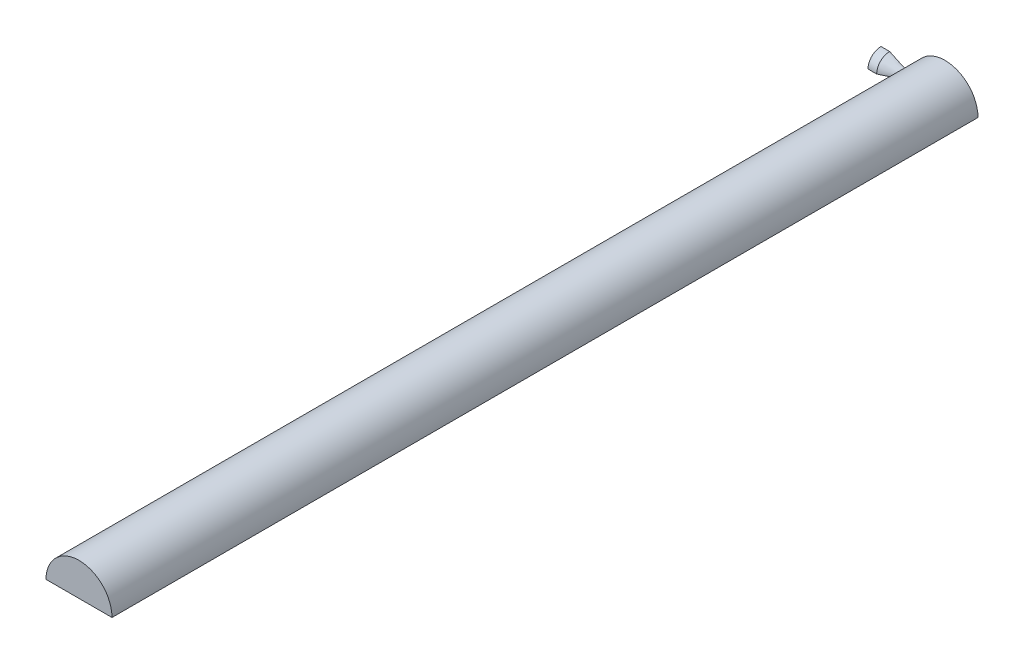
ISO-10303-21;
HEADER;
FILE_DESCRIPTION(('STEP AP214'),'2;1');
FILE_NAME('part.step','',(''),(''),'','','');
FILE_SCHEMA(('AUTOMOTIVE_DESIGN { 1 0 10303 214 1 1 1 1 }'));
ENDSEC;
DATA;
#1=APPLICATION_CONTEXT('core data for automotive mechanical design processes');
#2=APPLICATION_PROTOCOL_DEFINITION('international standard','automotive_design',2000,#1);
#3=PRODUCT_CONTEXT('',#1,'mechanical');
#4=PRODUCT('Part','Part','',(#3));
#5=PRODUCT_RELATED_PRODUCT_CATEGORY('part','',(#4));
#6=PRODUCT_DEFINITION_FORMATION('','',#4);
#7=PRODUCT_DEFINITION_CONTEXT('part definition',#1,'design');
#8=PRODUCT_DEFINITION('design','',#6,#7);
#9=PRODUCT_DEFINITION_SHAPE('','',#8);
#10=(LENGTH_UNIT() NAMED_UNIT(*) SI_UNIT(.MILLI.,.METRE.));
#11=(NAMED_UNIT(*) PLANE_ANGLE_UNIT() SI_UNIT($,.RADIAN.));
#12=(NAMED_UNIT(*) SI_UNIT($,.STERADIAN.) SOLID_ANGLE_UNIT());
#13=UNCERTAINTY_MEASURE_WITH_UNIT(LENGTH_MEASURE(1.E-05),#10,'distance_accuracy_value','');
#14=(GEOMETRIC_REPRESENTATION_CONTEXT(3) GLOBAL_UNCERTAINTY_ASSIGNED_CONTEXT((#13)) GLOBAL_UNIT_ASSIGNED_CONTEXT((#10,
#11,#12)) REPRESENTATION_CONTEXT('',''));
#15=CARTESIAN_POINT('',(0.,0.,0.));
#16=DIRECTION('',(0.,0.,1.));
#17=DIRECTION('',(1.,0.,0.));
#18=AXIS2_PLACEMENT_3D('',#15,#16,#17);
#19=CARTESIAN_POINT('',(-10.6541824341614,0.,15.0199999998294));
#20=DIRECTION('',(1.,0.,0.));
#21=DIRECTION('',(0.,1.,0.));
#22=AXIS2_PLACEMENT_3D('',#19,#20,#21);
#23=PLANE('',#22);
#24=CARTESIAN_POINT('',(-10.6541824341614,0.,0.));
#25=DIRECTION('',(-1.,0.,0.));
#26=DIRECTION('',(0.,-1.,0.));
#27=AXIS2_PLACEMENT_3D('',#24,#25,#26);
#28=CIRCLE('',#27,15.0199999998294);
#29=CARTESIAN_POINT('',(-10.6541824341614,0.,15.0199999998294));
#30=VERTEX_POINT('',#29);
#31=CARTESIAN_POINT('',(-10.6541824341614,15.0199999998294,0.));
#32=VERTEX_POINT('',#31);
#33=EDGE_CURVE('E11',#30,#32,#28,.T.);
#34=ORIENTED_EDGE('',*,*,#33,.T.);
#35=DIRECTION('',(0.,-1.,0.));
#36=VECTOR('',#35,1.);
#37=CARTESIAN_POINT('',(-10.6541824341614,15.0199999998294,0.));
#38=LINE('',#37,#36);
#39=CARTESIAN_POINT('',(-10.6541824341614,0.,0.));
#40=VERTEX_POINT('',#39);
#41=EDGE_CURVE('E56',#32,#40,#38,.T.);
#42=ORIENTED_EDGE('',*,*,#41,.T.);
#43=DIRECTION('',(0.,0.,-1.));
#44=VECTOR('',#43,1.);
#45=CARTESIAN_POINT('',(-10.6541824341614,0.,15.0199999998294));
#46=LINE('',#45,#44);
#47=EDGE_CURVE('E139',#30,#40,#46,.T.);
#48=ORIENTED_EDGE('',*,*,#47,.F.);
#49=EDGE_LOOP('',(#34,#42,#48));
#50=FACE_BOUND('',#49,.T.);
#51=ADVANCED_FACE('F35',(#50),#23,.F.);
#52=CARTESIAN_POINT('',(0.,0.,0.));
#53=DIRECTION('',(-1.,0.,0.));
#54=DIRECTION('',(0.,-1.,0.));
#55=AXIS2_PLACEMENT_3D('',#52,#53,#54);
#56=CYLINDRICAL_SURFACE('',#55,15.0199999997248);
#57=CARTESIAN_POINT('',(-0.654182433727519,0.,0.));
#58=DIRECTION('',(-1.,0.,0.));
#59=DIRECTION('',(0.,-1.,0.));
#60=AXIS2_PLACEMENT_3D('',#57,#58,#59);
#61=CIRCLE('',#60,15.0199999996203);
#62=CARTESIAN_POINT('',(-0.654182433727519,0.,15.0199999996203));
#63=VERTEX_POINT('',#62);
#64=CARTESIAN_POINT('',(-0.654182433727519,15.0199999996203,0.));
#65=VERTEX_POINT('',#64);
#66=EDGE_CURVE('E42',#63,#65,#61,.T.);
#67=ORIENTED_EDGE('',*,*,#66,.T.);
#68=DIRECTION('',(-1.,0.,0.));
#69=VECTOR('',#68,1.);
#70=CARTESIAN_POINT('',(-0.65418243416139,15.0199999998294,0.));
#71=LINE('',#70,#69);
#72=EDGE_CURVE('E143',#65,#32,#71,.T.);
#73=ORIENTED_EDGE('',*,*,#72,.T.);
#74=ORIENTED_EDGE('',*,*,#33,.F.);
#75=DIRECTION('',(-1.,0.,0.));
#76=VECTOR('',#75,1.);
#77=CARTESIAN_POINT('',(-0.65418243416139,0.,15.0199999998294));
#78=LINE('',#77,#76);
#79=EDGE_CURVE('E152',#63,#30,#78,.T.);
#80=ORIENTED_EDGE('',*,*,#79,.F.);
#81=EDGE_LOOP('',(#67,#73,#74,#80));
#82=FACE_BOUND('',#81,.T.);
#83=ADVANCED_FACE('F132',(#82),#56,.T.);
#84=CARTESIAN_POINT('',(25.4000000001663,0.,4.50000000000144));
#85=CARTESIAN_POINT('',(25.3598892369349,0.,4.49766910880118));
#86=CARTESIAN_POINT('',(25.2793812236262,0.,4.49375722895618));
#87=CARTESIAN_POINT('',(25.1247014310143,0.,4.48821861080727));
#88=CARTESIAN_POINT('',(24.9185956291807,0.,4.48540205418157));
#89=CARTESIAN_POINT('',(24.669284767566,0.,4.48881344717539));
#90=CARTESIAN_POINT('',(24.3542772353756,0.,4.50362498326314));
#91=CARTESIAN_POINT('',(23.9540913952493,0.,4.53807247092198));
#92=CARTESIAN_POINT('',(23.4644926829741,0.,4.6056330484024));
#93=CARTESIAN_POINT('',(22.8970359564531,0.,4.71029829721143));
#94=CARTESIAN_POINT('',(22.2155910122414,0.,4.87093447759818));
#95=CARTESIAN_POINT('',(21.3941677703144,0.,5.10357874497299));
#96=CARTESIAN_POINT('',(20.2387943291148,0.,5.48620744414766));
#97=CARTESIAN_POINT('',(18.7555681400774,0.,6.04420734604229));
#98=CARTESIAN_POINT('',(16.9507618636853,0.,6.79193377986655));
#99=CARTESIAN_POINT('',(14.9441194234548,0.,7.66978709691856));
#100=CARTESIAN_POINT('',(12.8108352821432,0.,8.63757914985836));
#101=CARTESIAN_POINT('',(10.7908859868668,0.,9.57062971311794));
#102=CARTESIAN_POINT('',(8.6069164760832,0.,10.5958925304816));
#103=CARTESIAN_POINT('',(6.70161347793502,0.,11.4959941901035));
#104=CARTESIAN_POINT('',(4.34709546986782,0.,12.6191359749948));
#105=CARTESIAN_POINT('',(2.74095302003808,0.,13.3865455831407));
#106=CARTESIAN_POINT('',(0.610598488645964,0.,14.4109823752598));
#107=CARTESIAN_POINT('',(-0.219836229306919,0.,14.8107043715923));
#108=CARTESIAN_POINT('',(-0.654182433727519,0.,15.0199999996203));
#109=B_SPLINE_CURVE_WITH_KNOTS('',4,(#84,#85,#86,#87,#88,#89,#90,#91,#92,#93,#94,#95,#96,#97,
#98,#99,#100,#101,#102,#103,#104,#105,#106,#107,#108),.UNSPECIFIED.,.F.,.F.,(5,1,1,1,1,1,1,1,1,
1,1,1,1,1,1,1,1,1,1,1,1,5),(0.0837711383466936,0.0894580438699278,0.0951449494118813,
0.100831857128774,0.106518764845667,0.119305951784671,0.132954595217711,0.148282884432776,
0.165343636956093,0.187893612878861,0.215959045335083,0.250080574399926,0.309279050231924,
0.377522094918906,0.445765136876236,0.514008176525914,0.582251215893804,0.650494254504257,
0.718737291663222,0.786980329098938,0.855223366682504,0.923466404408107),.UNSPECIFIED.);
#110=CARTESIAN_POINT('',(0.,0.,0.));
#111=DIRECTION('',(-1.,0.,0.));
#112=AXIS1_PLACEMENT('',#110,#111);
#113=SURFACE_OF_REVOLUTION('',#109,#112);
#114=CARTESIAN_POINT('',(25.1333186502903,0.,4.48937976678184));
#115=VERTEX_POINT('',#114);
#116=EDGE_CURVE('E49',#115,#63,#109,.T.);
#117=ORIENTED_EDGE('',*,*,#116,.F.);
#118=CARTESIAN_POINT('',(25.1333186486835,0.,4.48937976674108));
#119=CARTESIAN_POINT('',(25.1333123550256,0.1262143194195,4.48939400196303));
#120=CARTESIAN_POINT('',(25.1339455997111,0.252425960385009,4.48407370155712));
#121=CARTESIAN_POINT('',(25.136445627307,0.503936919939426,4.46286737472985));
#122=CARTESIAN_POINT('',(25.1383123163836,0.629236307194562,4.44698215202919));
#123=CARTESIAN_POINT('',(25.1432311197821,0.877904463410625,4.40477150044536));
#124=CARTESIAN_POINT('',(25.1462819855788,1.00127512386031,4.3784570668842));
#125=CARTESIAN_POINT('',(25.1534812886473,1.24534490263722,4.31558787384773));
#126=CARTESIAN_POINT('',(25.1576297192382,1.36604403722118,4.27903317670476));
#127=CARTESIAN_POINT('',(25.1669088477268,1.60393928451326,4.19594397239583));
#128=CARTESIAN_POINT('',(25.1720397031774,1.72113483185601,4.14940786435253));
#129=CARTESIAN_POINT('',(25.1831412938393,1.95122406166274,4.0466779616435));
#130=CARTESIAN_POINT('',(25.1891123392547,2.06411613560019,3.99048059826683));
#131=CARTESIAN_POINT('',(25.2017229749343,2.28471734209653,3.86886866960248));
#132=CARTESIAN_POINT('',(25.2083622722944,2.39242871509671,3.80345813759634));
#133=CARTESIAN_POINT('',(25.2221286596426,2.60201278506277,3.66383715878138));
#134=CARTESIAN_POINT('',(25.2292559293507,2.70388330518784,3.58962346231934));
#135=CARTESIAN_POINT('',(25.2438270715484,2.90144501481282,3.43260884471517));
#136=CARTESIAN_POINT('',(25.2512721330366,2.99710886436673,3.34977363140406));
#137=CARTESIAN_POINT('',(25.2662439429768,3.18115834480224,3.1763184581309));
#138=CARTESIAN_POINT('',(25.273770720899,3.2695412440432,3.08569560224708));
#139=CARTESIAN_POINT('',(25.2886891123713,3.43835287396168,2.89733733700644));
#140=CARTESIAN_POINT('',(25.2960807473769,3.51878287634694,2.79960306915252));
#141=CARTESIAN_POINT('',(25.3105227741409,3.6711597889791,2.59765251525863));
#142=CARTESIAN_POINT('',(25.3175730438575,3.74310367835655,2.49343394099318));
#143=CARTESIAN_POINT('',(25.3311415089628,3.8780898455741,2.27905920335932));
#144=CARTESIAN_POINT('',(25.3376586217419,3.94111419218129,2.16889167771414));
#145=CARTESIAN_POINT('',(25.3499568254499,4.05762617328341,1.94358569240856));
#146=CARTESIAN_POINT('',(25.3557379187343,4.11111383829878,1.82844724865816));
#147=CARTESIAN_POINT('',(25.366392606407,4.20812253465652,1.59407604825388));
#148=CARTESIAN_POINT('',(25.3712667152201,4.25164921892208,1.47484565821117));
#149=CARTESIAN_POINT('',(25.3799675971631,4.32842950014587,1.23313239585469));
#150=CARTESIAN_POINT('',(25.3837946104571,4.36168545304644,1.11065027644656));
#151=CARTESIAN_POINT('',(25.3912889201898,4.42630515052261,0.825109905657071));
#152=CARTESIAN_POINT('',(25.3945441856774,4.45393314807813,0.661170473364432));
#153=CARTESIAN_POINT('',(25.3978110863391,4.48156657092486,0.41389127560465));
#154=CARTESIAN_POINT('',(25.3986307150297,4.48847627618719,0.331270443892983));
#155=CARTESIAN_POINT('',(25.3997254481384,4.49769255144093,0.165773338982595));
#156=CARTESIAN_POINT('',(25.400000582173,4.49999937179583,0.0828970799228661));
#157=CARTESIAN_POINT('',(25.3999999996373,4.4999999999707,0.));
#158=B_SPLINE_CURVE_WITH_KNOTS('',3,(#118,#119,#120,#121,#122,#123,#124,#125,#126,#127,#128,
#129,#130,#131,#132,#133,#134,#135,#136,#137,#138,#139,#140,#141,#142,#143,#144,#145,#146,#147,
#148,#149,#150,#151,#152,#153,#154,#155,#156,#157),.UNSPECIFIED.,.F.,.F.,(4,2,2,2,2,2,2,2,2,2,2,
2,2,2,2,2,2,2,2,4),(0.,0.378525374275452,0.757021955732911,1.13512055231062,1.513216847457,
1.89137382931499,2.26967079754075,2.64780266912708,3.02607456355091,3.40591312288217,
3.7858935457469,4.16581310925721,4.54586751020474,4.92667541146833,5.30748209400269,
5.68807212729605,6.06857479433959,6.56624089286617,6.81487161468317,7.06348881242718),.UNSPECIFIED.);
#159=CARTESIAN_POINT('',(25.399999999638,4.49999999997665,0.));
#160=VERTEX_POINT('',#159);
#161=EDGE_CURVE('E104',#115,#160,#158,.T.);
#162=ORIENTED_EDGE('',*,*,#161,.T.);
#163=CARTESIAN_POINT('',(25.4000000001663,4.50000000000144,0.));
#164=CARTESIAN_POINT('',(25.3598892369349,4.49766910880118,0.));
#165=CARTESIAN_POINT('',(25.2793812236262,4.49375722895618,0.));
#166=CARTESIAN_POINT('',(25.1247014310143,4.48821861080727,0.));
#167=CARTESIAN_POINT('',(24.9185956291807,4.48540205418157,0.));
#168=CARTESIAN_POINT('',(24.669284767566,4.48881344717539,0.));
#169=CARTESIAN_POINT('',(24.3542772353756,4.50362498326314,0.));
#170=CARTESIAN_POINT('',(23.9540913952493,4.53807247092198,0.));
#171=CARTESIAN_POINT('',(23.4644926829741,4.6056330484024,0.));
#172=CARTESIAN_POINT('',(22.8970359564531,4.71029829721143,0.));
#173=CARTESIAN_POINT('',(22.2155910122414,4.87093447759818,0.));
#174=CARTESIAN_POINT('',(21.3941677703144,5.10357874497299,0.));
#175=CARTESIAN_POINT('',(20.2387943291148,5.48620744414766,0.));
#176=CARTESIAN_POINT('',(18.7555681400774,6.04420734604229,0.));
#177=CARTESIAN_POINT('',(16.9507618636853,6.79193377986655,0.));
#178=CARTESIAN_POINT('',(14.9441194234548,7.66978709691856,0.));
#179=CARTESIAN_POINT('',(12.8108352821432,8.63757914985836,0.));
#180=CARTESIAN_POINT('',(10.7908859868668,9.57062971311794,0.));
#181=CARTESIAN_POINT('',(8.6069164760832,10.5958925304816,0.));
#182=CARTESIAN_POINT('',(6.70161347793502,11.4959941901035,0.));
#183=CARTESIAN_POINT('',(4.34709546986782,12.6191359749948,0.));
#184=CARTESIAN_POINT('',(2.74095302003808,13.3865455831407,0.));
#185=CARTESIAN_POINT('',(0.610598488645964,14.4109823752598,0.));
#186=CARTESIAN_POINT('',(-0.219836229306919,14.8107043715923,0.));
#187=CARTESIAN_POINT('',(-0.654182433727519,15.0199999996203,0.));
#188=B_SPLINE_CURVE_WITH_KNOTS('',4,(#163,#164,#165,#166,#167,#168,#169,#170,#171,#172,#173,
#174,#175,#176,#177,#178,#179,#180,#181,#182,#183,#184,#185,#186,#187),.UNSPECIFIED.,.F.,.F.,(5,
1,1,1,1,1,1,1,1,1,1,1,1,1,1,1,1,1,1,1,1,5),(0.0837711383466936,0.0894580438699278,
0.0951449494118813,0.100831857128774,0.106518764845667,0.119305951784671,0.132954595217711,
0.148282884432776,0.165343636956093,0.187893612878861,0.215959045335083,0.250080574399926,
0.309279050231924,0.377522094918906,0.445765136876236,0.514008176525914,0.582251215893804,
0.650494254504257,0.718737291663222,0.786980329098938,0.855223366682504,0.923466404408107),.UNSPECIFIED.);
#189=EDGE_CURVE('E113',#160,#65,#188,.T.);
#190=ORIENTED_EDGE('',*,*,#189,.T.);
#191=ORIENTED_EDGE('',*,*,#66,.F.);
#192=EDGE_LOOP('',(#117,#162,#190,#191));
#193=FACE_BOUND('',#192,.T.);
#194=ADVANCED_FACE('F117',(#193),#113,.T.);
#195=CARTESIAN_POINT('',(12.1131651748484,0.,8.96149231744127));
#196=DIRECTION('',(0.,1.,0.));
#197=DIRECTION('',(-1.,0.,0.));
#198=AXIS2_PLACEMENT_3D('',#195,#196,#197);
#199=PLANE('',#198);
#200=DIRECTION('',(0.,0.,-1.));
#201=VECTOR('',#200,1.);
#202=CARTESIAN_POINT('',(25.1333186486835,0.,1000.));
#203=LINE('',#202,#201);
#204=CARTESIAN_POINT('',(25.1333186486835,0.,1000.));
#205=VERTEX_POINT('',#204);
#206=EDGE_CURVE('E97',#205,#115,#203,.T.);
#207=ORIENTED_EDGE('',*,*,#206,.T.);
#208=ORIENTED_EDGE('',*,*,#116,.T.);
#209=ORIENTED_EDGE('',*,*,#79,.T.);
#210=ORIENTED_EDGE('',*,*,#47,.T.);
#211=DIRECTION('',(1.,0.,0.));
#212=VECTOR('',#211,1.);
#213=CARTESIAN_POINT('',(0.,0.,0.));
#214=LINE('',#213,#212);
#215=CARTESIAN_POINT('',(101.333318648683,0.,0.));
#216=VERTEX_POINT('',#215);
#217=EDGE_CURVE('E93',#40,#216,#214,.T.);
#218=ORIENTED_EDGE('',*,*,#217,.T.);
#219=DIRECTION('',(0.,0.,-1.));
#220=VECTOR('',#219,1.);
#221=CARTESIAN_POINT('',(101.333318648683,0.,1000.));
#222=LINE('',#221,#220);
#223=CARTESIAN_POINT('',(101.333318648683,0.,1000.));
#224=VERTEX_POINT('',#223);
#225=EDGE_CURVE('E88',#224,#216,#222,.T.);
#226=ORIENTED_EDGE('',*,*,#225,.F.);
#227=DIRECTION('',(1.,0.,0.));
#228=VECTOR('',#227,1.);
#229=CARTESIAN_POINT('',(25.1333186486835,0.,1000.));
#230=LINE('',#229,#228);
#231=EDGE_CURVE('E81',#205,#224,#230,.T.);
#232=ORIENTED_EDGE('',*,*,#231,.F.);
#233=EDGE_LOOP('',(#207,#208,#209,#210,#218,#226,#232));
#234=FACE_BOUND('',#233,.T.);
#235=ADVANCED_FACE('F91',(#234),#199,.F.);
#236=CARTESIAN_POINT('',(12.1131651748484,8.96149231744127,0.));
#237=DIRECTION('',(0.,0.,-1.));
#238=DIRECTION('',(-1.,0.,0.));
#239=AXIS2_PLACEMENT_3D('',#236,#237,#238);
#240=PLANE('',#239);
#241=ORIENTED_EDGE('',*,*,#189,.F.);
#242=CARTESIAN_POINT('',(63.2333186486835,0.,0.));
#243=DIRECTION('',(0.,0.,-1.));
#244=DIRECTION('',(-1.,0.,0.));
#245=AXIS2_PLACEMENT_3D('',#242,#243,#244);
#246=CIRCLE('',#245,38.1);
#247=EDGE_CURVE('E100',#160,#216,#246,.T.);
#248=ORIENTED_EDGE('',*,*,#247,.T.);
#249=ORIENTED_EDGE('',*,*,#217,.F.);
#250=ORIENTED_EDGE('',*,*,#41,.F.);
#251=ORIENTED_EDGE('',*,*,#72,.F.);
#252=EDGE_LOOP('',(#241,#248,#249,#250,#251));
#253=FACE_BOUND('',#252,.T.);
#254=ADVANCED_FACE('F125',(#253),#240,.T.);
#255=CARTESIAN_POINT('',(63.2333186486835,0.,1000.));
#256=DIRECTION('',(0.,0.,-1.));
#257=DIRECTION('',(-1.,0.,0.));
#258=AXIS2_PLACEMENT_3D('',#255,#256,#257);
#259=CYLINDRICAL_SURFACE('',#258,38.1);
#260=ORIENTED_EDGE('',*,*,#161,.F.);
#261=ORIENTED_EDGE('',*,*,#206,.F.);
#262=CARTESIAN_POINT('',(63.2333186486835,0.,1000.));
#263=DIRECTION('',(0.,0.,-1.));
#264=DIRECTION('',(-1.,0.,0.));
#265=AXIS2_PLACEMENT_3D('',#262,#263,#264);
#266=CIRCLE('',#265,38.1);
#267=EDGE_CURVE('E85',#205,#224,#266,.T.);
#268=ORIENTED_EDGE('',*,*,#267,.T.);
#269=ORIENTED_EDGE('',*,*,#225,.T.);
#270=ORIENTED_EDGE('',*,*,#247,.F.);
#271=EDGE_LOOP('',(#260,#261,#268,#269,#270));
#272=FACE_BOUND('',#271,.T.);
#273=ADVANCED_FACE('F99',(#272),#259,.T.);
#274=CARTESIAN_POINT('',(63.2333186486835,0.,1000.));
#275=DIRECTION('',(0.,0.,-1.));
#276=DIRECTION('',(-1.,0.,0.));
#277=AXIS2_PLACEMENT_3D('',#274,#275,#276);
#278=PLANE('',#277);
#279=ORIENTED_EDGE('',*,*,#267,.F.);
#280=ORIENTED_EDGE('',*,*,#231,.T.);
#281=EDGE_LOOP('',(#279,#280));
#282=FACE_BOUND('',#281,.T.);
#283=ADVANCED_FACE('F83',(#282),#278,.F.);
#284=CLOSED_SHELL('',(#51,#83,#194,#235,#254,#273,#283));
#285=MANIFOLD_SOLID_BREP('B2',#284);
#286=ADVANCED_BREP_SHAPE_REPRESENTATION('',(#18,#285),#14);
#287=SHAPE_DEFINITION_REPRESENTATION(#9,#286);
ENDSEC;
END-ISO-10303-21;
